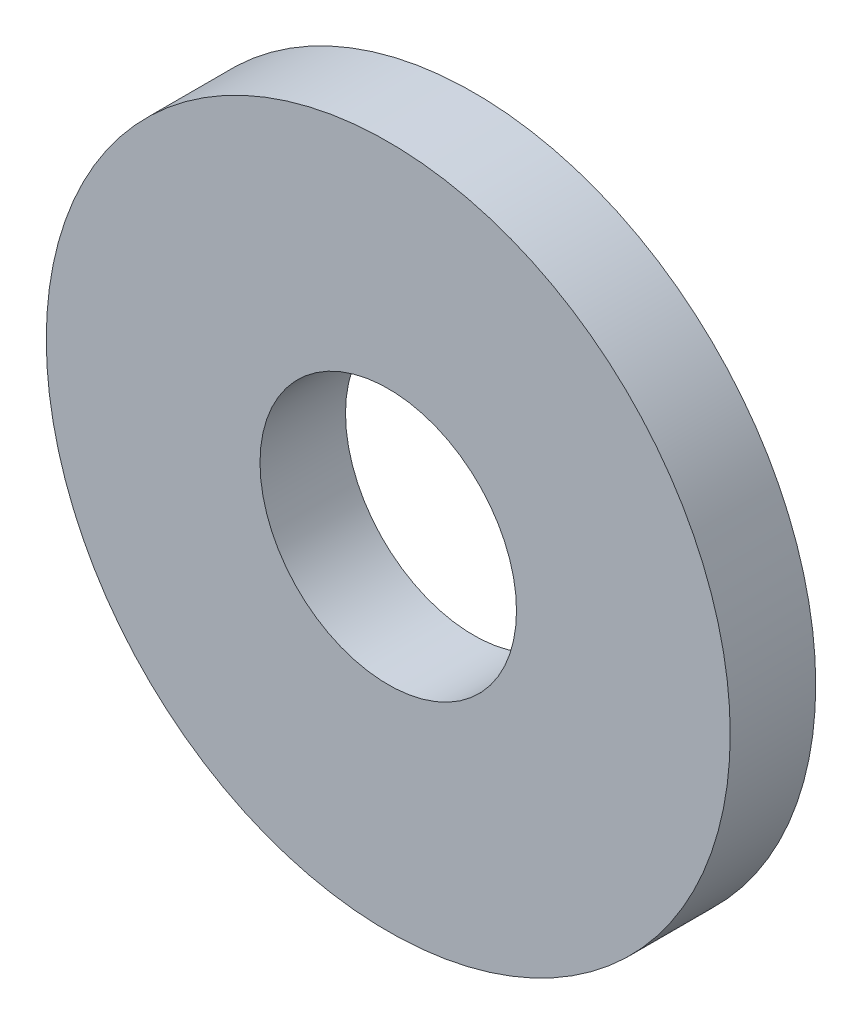
ISO-10303-21;
HEADER;
FILE_DESCRIPTION(('STEP AP214'),'2;1');
FILE_NAME('part.step','',(''),(''),'','','');
FILE_SCHEMA(('AUTOMOTIVE_DESIGN { 1 0 10303 214 1 1 1 1 }'));
ENDSEC;
DATA;
#1=APPLICATION_CONTEXT('core data for automotive mechanical design processes');
#2=APPLICATION_PROTOCOL_DEFINITION('international standard','automotive_design',2000,#1);
#3=PRODUCT_CONTEXT('',#1,'mechanical');
#4=PRODUCT('Part','Part','',(#3));
#5=PRODUCT_RELATED_PRODUCT_CATEGORY('part','',(#4));
#6=PRODUCT_DEFINITION_FORMATION('','',#4);
#7=PRODUCT_DEFINITION_CONTEXT('part definition',#1,'design');
#8=PRODUCT_DEFINITION('design','',#6,#7);
#9=PRODUCT_DEFINITION_SHAPE('','',#8);
#10=(LENGTH_UNIT() NAMED_UNIT(*) SI_UNIT(.MILLI.,.METRE.));
#11=(NAMED_UNIT(*) PLANE_ANGLE_UNIT() SI_UNIT($,.RADIAN.));
#12=(NAMED_UNIT(*) SI_UNIT($,.STERADIAN.) SOLID_ANGLE_UNIT());
#13=UNCERTAINTY_MEASURE_WITH_UNIT(LENGTH_MEASURE(1.E-05),#10,'distance_accuracy_value','');
#14=(GEOMETRIC_REPRESENTATION_CONTEXT(3) GLOBAL_UNCERTAINTY_ASSIGNED_CONTEXT((#13)) GLOBAL_UNIT_ASSIGNED_CONTEXT((#10,
#11,#12)) REPRESENTATION_CONTEXT('',''));
#15=CARTESIAN_POINT('',(0.,0.,0.));
#16=DIRECTION('',(0.,0.,1.));
#17=DIRECTION('',(1.,0.,0.));
#18=AXIS2_PLACEMENT_3D('',#15,#16,#17);
#19=CARTESIAN_POINT('',(0.,0.,3.175));
#20=DIRECTION('',(0.,0.,1.));
#21=DIRECTION('',(1.,0.,0.));
#22=AXIS2_PLACEMENT_3D('',#19,#20,#21);
#23=PLANE('',#22);
#24=CARTESIAN_POINT('',(0.,0.,3.175));
#25=DIRECTION('',(0.,0.,1.));
#26=DIRECTION('',(1.,0.,0.));
#27=AXIS2_PLACEMENT_3D('',#24,#25,#26);
#28=CIRCLE('',#27,12.7);
#29=CARTESIAN_POINT('',(12.7,0.,3.175));
#30=VERTEX_POINT('',#29);
#31=EDGE_CURVE('E10',#30,#30,#28,.T.);
#32=ORIENTED_EDGE('',*,*,#31,.T.);
#33=EDGE_LOOP('',(#32));
#34=FACE_BOUND('',#33,.T.);
#35=CARTESIAN_POINT('',(0.,0.,3.175));
#36=DIRECTION('',(0.,0.,1.));
#37=DIRECTION('',(1.,0.,0.));
#38=AXIS2_PLACEMENT_3D('',#35,#36,#37);
#39=CIRCLE('',#38,4.7625);
#40=CARTESIAN_POINT('',(4.7625,0.,3.175));
#41=VERTEX_POINT('',#40);
#42=EDGE_CURVE('E50',#41,#41,#39,.T.);
#43=ORIENTED_EDGE('',*,*,#42,.F.);
#44=EDGE_LOOP('',(#43));
#45=FACE_BOUND('',#44,.T.);
#46=ADVANCED_FACE('F37',(#34,#45),#23,.T.);
#47=CARTESIAN_POINT('',(0.,0.,0.));
#48=DIRECTION('',(0.,0.,1.));
#49=DIRECTION('',(1.,0.,0.));
#50=AXIS2_PLACEMENT_3D('',#47,#48,#49);
#51=PLANE('',#50);
#52=CARTESIAN_POINT('',(0.,0.,0.));
#53=DIRECTION('',(0.,0.,1.));
#54=DIRECTION('',(1.,0.,0.));
#55=AXIS2_PLACEMENT_3D('',#52,#53,#54);
#56=CIRCLE('',#55,12.7);
#57=CARTESIAN_POINT('',(12.7,0.,0.));
#58=VERTEX_POINT('',#57);
#59=EDGE_CURVE('E41',#58,#58,#56,.T.);
#60=ORIENTED_EDGE('',*,*,#59,.F.);
#61=EDGE_LOOP('',(#60));
#62=FACE_BOUND('',#61,.T.);
#63=CARTESIAN_POINT('',(0.,0.,0.));
#64=DIRECTION('',(0.,0.,1.));
#65=DIRECTION('',(1.,0.,0.));
#66=AXIS2_PLACEMENT_3D('',#63,#64,#65);
#67=CIRCLE('',#66,4.7625);
#68=CARTESIAN_POINT('',(4.7625,0.,0.));
#69=VERTEX_POINT('',#68);
#70=EDGE_CURVE('E52',#69,#69,#67,.T.);
#71=ORIENTED_EDGE('',*,*,#70,.T.);
#72=EDGE_LOOP('',(#71));
#73=FACE_BOUND('',#72,.T.);
#74=ADVANCED_FACE('F64',(#62,#73),#51,.F.);
#75=CARTESIAN_POINT('',(0.,0.,3.175));
#76=DIRECTION('',(0.,0.,-1.));
#77=DIRECTION('',(-1.,0.,0.));
#78=AXIS2_PLACEMENT_3D('',#75,#76,#77);
#79=CYLINDRICAL_SURFACE('',#78,12.7);
#80=ORIENTED_EDGE('',*,*,#31,.F.);
#81=EDGE_LOOP('',(#80));
#82=FACE_BOUND('',#81,.T.);
#83=ORIENTED_EDGE('',*,*,#59,.T.);
#84=EDGE_LOOP('',(#83));
#85=FACE_BOUND('',#84,.T.);
#86=ADVANCED_FACE('F39',(#82,#85),#79,.T.);
#87=CARTESIAN_POINT('',(0.,0.,3.175));
#88=DIRECTION('',(0.,0.,-1.));
#89=DIRECTION('',(-1.,0.,0.));
#90=AXIS2_PLACEMENT_3D('',#87,#88,#89);
#91=CYLINDRICAL_SURFACE('',#90,4.7625);
#92=ORIENTED_EDGE('',*,*,#42,.T.);
#93=EDGE_LOOP('',(#92));
#94=FACE_BOUND('',#93,.T.);
#95=ORIENTED_EDGE('',*,*,#70,.F.);
#96=EDGE_LOOP('',(#95));
#97=FACE_BOUND('',#96,.T.);
#98=ADVANCED_FACE('F60',(#94,#97),#91,.F.);
#99=CLOSED_SHELL('',(#46,#74,#86,#98));
#100=MANIFOLD_SOLID_BREP('B2',#99);
#101=ADVANCED_BREP_SHAPE_REPRESENTATION('',(#18,#100),#14);
#102=SHAPE_DEFINITION_REPRESENTATION(#9,#101);
ENDSEC;
END-ISO-10303-21;
